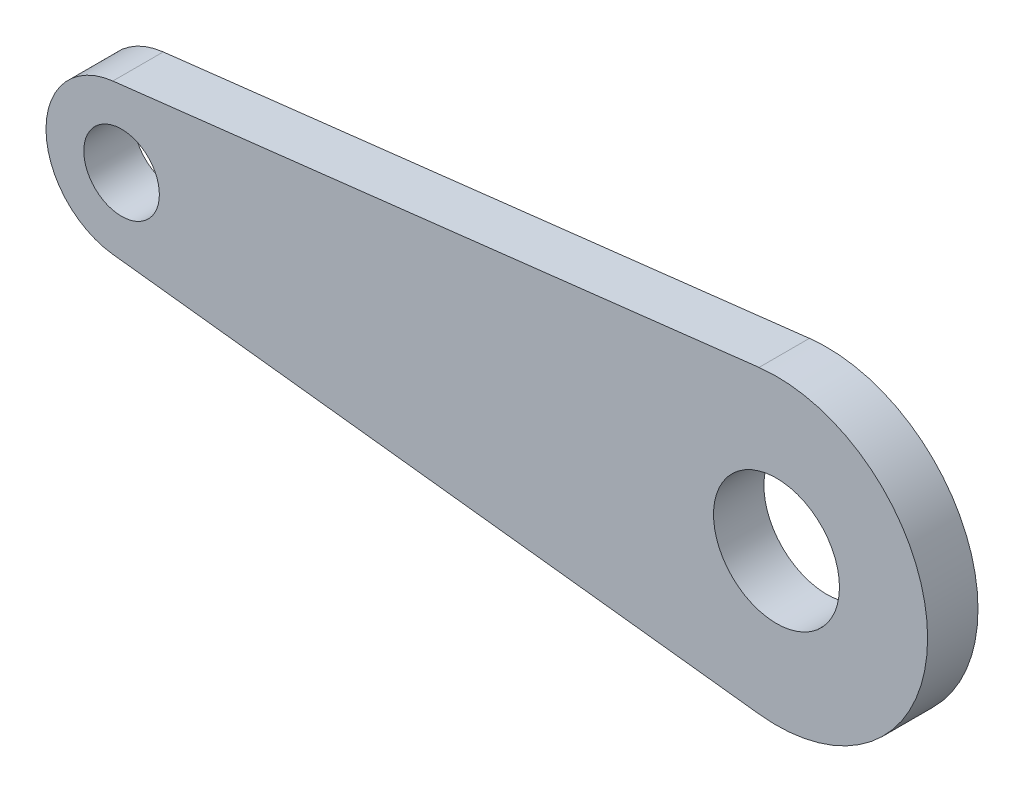
ISO-10303-21;
HEADER;
FILE_DESCRIPTION(('STEP AP214'),'2;1');
FILE_NAME('part.step','',(''),(''),'','','');
FILE_SCHEMA(('AUTOMOTIVE_DESIGN { 1 0 10303 214 1 1 1 1 }'));
ENDSEC;
DATA;
#1=APPLICATION_CONTEXT('core data for automotive mechanical design processes');
#2=APPLICATION_PROTOCOL_DEFINITION('international standard','automotive_design',2000,#1);
#3=PRODUCT_CONTEXT('',#1,'mechanical');
#4=PRODUCT('Part','Part','',(#3));
#5=PRODUCT_RELATED_PRODUCT_CATEGORY('part','',(#4));
#6=PRODUCT_DEFINITION_FORMATION('','',#4);
#7=PRODUCT_DEFINITION_CONTEXT('part definition',#1,'design');
#8=PRODUCT_DEFINITION('design','',#6,#7);
#9=PRODUCT_DEFINITION_SHAPE('','',#8);
#10=(LENGTH_UNIT() NAMED_UNIT(*) SI_UNIT(.MILLI.,.METRE.));
#11=(NAMED_UNIT(*) PLANE_ANGLE_UNIT() SI_UNIT($,.RADIAN.));
#12=(NAMED_UNIT(*) SI_UNIT($,.STERADIAN.) SOLID_ANGLE_UNIT());
#13=UNCERTAINTY_MEASURE_WITH_UNIT(LENGTH_MEASURE(1.E-05),#10,'distance_accuracy_value','');
#14=(GEOMETRIC_REPRESENTATION_CONTEXT(3) GLOBAL_UNCERTAINTY_ASSIGNED_CONTEXT((#13)) GLOBAL_UNIT_ASSIGNED_CONTEXT((#10,
#11,#12)) REPRESENTATION_CONTEXT('',''));
#15=CARTESIAN_POINT('',(0.,0.,0.));
#16=DIRECTION('',(0.,0.,1.));
#17=DIRECTION('',(1.,0.,0.));
#18=AXIS2_PLACEMENT_3D('',#15,#16,#17);
#19=CARTESIAN_POINT('',(0.,0.,10.));
#20=DIRECTION('',(0.,0.,1.));
#21=DIRECTION('',(1.,0.,0.));
#22=AXIS2_PLACEMENT_3D('',#19,#20,#21);
#23=PLANE('',#22);
#24=CARTESIAN_POINT('',(0.,0.,10.));
#25=DIRECTION('',(0.,0.,1.));
#26=DIRECTION('',(1.,0.,0.));
#27=AXIS2_PLACEMENT_3D('',#24,#25,#26);
#28=CIRCLE('',#27,7.5);
#29=CARTESIAN_POINT('',(7.5,0.,10.));
#30=VERTEX_POINT('',#29);
#31=EDGE_CURVE('E102',#30,#30,#28,.T.);
#32=ORIENTED_EDGE('',*,*,#31,.F.);
#33=EDGE_LOOP('',(#32));
#34=FACE_BOUND('',#33,.T.);
#35=CARTESIAN_POINT('',(0.,0.,10.));
#36=DIRECTION('',(0.,0.,1.));
#37=DIRECTION('',(1.,0.,0.));
#38=AXIS2_PLACEMENT_3D('',#35,#36,#37);
#39=CIRCLE('',#38,15.);
#40=CARTESIAN_POINT('',(-1.73076923076923,14.8998133501673,10.));
#41=VERTEX_POINT('',#40);
#42=CARTESIAN_POINT('',(-1.73076923076923,-14.8998133501673,10.));
#43=VERTEX_POINT('',#42);
#44=EDGE_CURVE('E87',#41,#43,#39,.T.);
#45=ORIENTED_EDGE('',*,*,#44,.T.);
#46=DIRECTION('',(0.993320890011151,-0.115384615384615,0.));
#47=VECTOR('',#46,1.);
#48=CARTESIAN_POINT('',(-1.73076923076923,-14.8998133501673,10.));
#49=LINE('',#48,#47);
#50=CARTESIAN_POINT('',(126.538461538462,-29.7996267003345,10.));
#51=VERTEX_POINT('',#50);
#52=EDGE_CURVE('E82',#43,#51,#49,.T.);
#53=ORIENTED_EDGE('',*,*,#52,.T.);
#54=CARTESIAN_POINT('',(130.,0.,10.));
#55=DIRECTION('',(0.,0.,1.));
#56=DIRECTION('',(1.,0.,0.));
#57=AXIS2_PLACEMENT_3D('',#54,#55,#56);
#58=CIRCLE('',#57,30.);
#59=CARTESIAN_POINT('',(126.538461538462,29.7996267003345,10.));
#60=VERTEX_POINT('',#59);
#61=EDGE_CURVE('E85',#51,#60,#58,.T.);
#62=ORIENTED_EDGE('',*,*,#61,.T.);
#63=DIRECTION('',(-0.993320890011151,-0.115384615384615,0.));
#64=VECTOR('',#63,1.);
#65=CARTESIAN_POINT('',(-1.73076923076923,14.8998133501673,10.));
#66=LINE('',#65,#64);
#67=EDGE_CURVE('E52',#60,#41,#66,.T.);
#68=ORIENTED_EDGE('',*,*,#67,.T.);
#69=EDGE_LOOP('',(#45,#53,#62,#68));
#70=FACE_BOUND('',#69,.T.);
#71=CARTESIAN_POINT('',(130.,0.,10.));
#72=DIRECTION('',(0.,0.,1.));
#73=DIRECTION('',(1.,0.,0.));
#74=AXIS2_PLACEMENT_3D('',#71,#72,#73);
#75=CIRCLE('',#74,12.5);
#76=CARTESIAN_POINT('',(142.5,0.,10.));
#77=VERTEX_POINT('',#76);
#78=EDGE_CURVE('E117',#77,#77,#75,.T.);
#79=ORIENTED_EDGE('',*,*,#78,.F.);
#80=EDGE_LOOP('',(#79));
#81=FACE_BOUND('',#80,.T.);
#82=ADVANCED_FACE('F35',(#34,#70,#81),#23,.T.);
#83=CARTESIAN_POINT('',(0.,0.,0.));
#84=DIRECTION('',(0.,0.,1.));
#85=DIRECTION('',(1.,0.,0.));
#86=AXIS2_PLACEMENT_3D('',#83,#84,#85);
#87=PLANE('',#86);
#88=CARTESIAN_POINT('',(0.,0.,0.));
#89=DIRECTION('',(0.,0.,1.));
#90=DIRECTION('',(1.,0.,0.));
#91=AXIS2_PLACEMENT_3D('',#88,#89,#90);
#92=CIRCLE('',#91,15.);
#93=CARTESIAN_POINT('',(-1.73076923076923,14.8998133501673,0.));
#94=VERTEX_POINT('',#93);
#95=CARTESIAN_POINT('',(-1.73076923076923,-14.8998133501673,0.));
#96=VERTEX_POINT('',#95);
#97=EDGE_CURVE('E99',#94,#96,#92,.T.);
#98=ORIENTED_EDGE('',*,*,#97,.F.);
#99=DIRECTION('',(-0.993320890011151,-0.115384615384615,0.));
#100=VECTOR('',#99,1.);
#101=CARTESIAN_POINT('',(-1.73076923076923,14.8998133501673,0.));
#102=LINE('',#101,#100);
#103=CARTESIAN_POINT('',(126.538461538462,29.7996267003345,0.));
#104=VERTEX_POINT('',#103);
#105=EDGE_CURVE('E75',#104,#94,#102,.T.);
#106=ORIENTED_EDGE('',*,*,#105,.F.);
#107=CARTESIAN_POINT('',(130.,0.,0.));
#108=DIRECTION('',(0.,0.,1.));
#109=DIRECTION('',(1.,0.,0.));
#110=AXIS2_PLACEMENT_3D('',#107,#108,#109);
#111=CIRCLE('',#110,30.);
#112=CARTESIAN_POINT('',(126.538461538462,-29.7996267003345,0.));
#113=VERTEX_POINT('',#112);
#114=EDGE_CURVE('E69',#113,#104,#111,.T.);
#115=ORIENTED_EDGE('',*,*,#114,.F.);
#116=DIRECTION('',(0.993320890011151,-0.115384615384615,0.));
#117=VECTOR('',#116,1.);
#118=CARTESIAN_POINT('',(-1.73076923076923,-14.8998133501673,0.));
#119=LINE('',#118,#117);
#120=EDGE_CURVE('E91',#96,#113,#119,.T.);
#121=ORIENTED_EDGE('',*,*,#120,.F.);
#122=EDGE_LOOP('',(#98,#106,#115,#121));
#123=FACE_BOUND('',#122,.T.);
#124=CARTESIAN_POINT('',(0.,0.,0.));
#125=DIRECTION('',(0.,0.,1.));
#126=DIRECTION('',(1.,0.,0.));
#127=AXIS2_PLACEMENT_3D('',#124,#125,#126);
#128=CIRCLE('',#127,7.5);
#129=CARTESIAN_POINT('',(7.5,0.,0.));
#130=VERTEX_POINT('',#129);
#131=EDGE_CURVE('E114',#130,#130,#128,.T.);
#132=ORIENTED_EDGE('',*,*,#131,.T.);
#133=EDGE_LOOP('',(#132));
#134=FACE_BOUND('',#133,.T.);
#135=CARTESIAN_POINT('',(130.,0.,0.));
#136=DIRECTION('',(0.,0.,1.));
#137=DIRECTION('',(1.,0.,0.));
#138=AXIS2_PLACEMENT_3D('',#135,#136,#137);
#139=CIRCLE('',#138,12.5);
#140=CARTESIAN_POINT('',(142.5,0.,0.));
#141=VERTEX_POINT('',#140);
#142=EDGE_CURVE('E120',#141,#141,#139,.T.);
#143=ORIENTED_EDGE('',*,*,#142,.T.);
#144=EDGE_LOOP('',(#143));
#145=FACE_BOUND('',#144,.T.);
#146=ADVANCED_FACE('F110',(#123,#134,#145),#87,.F.);
#147=CARTESIAN_POINT('',(0.,0.,10.));
#148=DIRECTION('',(0.,0.,-1.));
#149=DIRECTION('',(-1.,0.,0.));
#150=AXIS2_PLACEMENT_3D('',#147,#148,#149);
#151=CYLINDRICAL_SURFACE('',#150,15.);
#152=ORIENTED_EDGE('',*,*,#97,.T.);
#153=DIRECTION('',(0.,0.,-1.));
#154=VECTOR('',#153,1.);
#155=CARTESIAN_POINT('',(-1.73076923076923,-14.8998133501673,10.));
#156=LINE('',#155,#154);
#157=EDGE_CURVE('E11',#43,#96,#156,.T.);
#158=ORIENTED_EDGE('',*,*,#157,.F.);
#159=ORIENTED_EDGE('',*,*,#44,.F.);
#160=DIRECTION('',(0.,0.,-1.));
#161=VECTOR('',#160,1.);
#162=CARTESIAN_POINT('',(-1.73076923076923,14.8998133501673,10.));
#163=LINE('',#162,#161);
#164=EDGE_CURVE('E95',#41,#94,#163,.T.);
#165=ORIENTED_EDGE('',*,*,#164,.T.);
#166=EDGE_LOOP('',(#152,#158,#159,#165));
#167=FACE_BOUND('',#166,.T.);
#168=ADVANCED_FACE('F37',(#167),#151,.T.);
#169=CARTESIAN_POINT('',(-1.73076923076923,-14.8998133501673,10.));
#170=DIRECTION('',(0.115384615384615,0.993320890011151,0.));
#171=DIRECTION('',(-0.993320890011151,0.115384615384615,0.));
#172=AXIS2_PLACEMENT_3D('',#169,#170,#171);
#173=PLANE('',#172);
#174=ORIENTED_EDGE('',*,*,#120,.T.);
#175=DIRECTION('',(0.,0.,-1.));
#176=VECTOR('',#175,1.);
#177=CARTESIAN_POINT('',(126.538461538462,-29.7996267003345,10.));
#178=LINE('',#177,#176);
#179=EDGE_CURVE('E44',#51,#113,#178,.T.);
#180=ORIENTED_EDGE('',*,*,#179,.F.);
#181=ORIENTED_EDGE('',*,*,#52,.F.);
#182=ORIENTED_EDGE('',*,*,#157,.T.);
#183=EDGE_LOOP('',(#174,#180,#181,#182));
#184=FACE_BOUND('',#183,.T.);
#185=ADVANCED_FACE('F90',(#184),#173,.F.);
#186=CARTESIAN_POINT('',(130.,0.,10.));
#187=DIRECTION('',(0.,0.,-1.));
#188=DIRECTION('',(-1.,0.,0.));
#189=AXIS2_PLACEMENT_3D('',#186,#187,#188);
#190=CYLINDRICAL_SURFACE('',#189,30.);
#191=ORIENTED_EDGE('',*,*,#114,.T.);
#192=DIRECTION('',(0.,0.,-1.));
#193=VECTOR('',#192,1.);
#194=CARTESIAN_POINT('',(126.538461538462,29.7996267003345,10.));
#195=LINE('',#194,#193);
#196=EDGE_CURVE('E92',#60,#104,#195,.T.);
#197=ORIENTED_EDGE('',*,*,#196,.F.);
#198=ORIENTED_EDGE('',*,*,#61,.F.);
#199=ORIENTED_EDGE('',*,*,#179,.T.);
#200=EDGE_LOOP('',(#191,#197,#198,#199));
#201=FACE_BOUND('',#200,.T.);
#202=ADVANCED_FACE('F93',(#201),#190,.T.);
#203=CARTESIAN_POINT('',(-1.73076923076923,14.8998133501673,10.));
#204=DIRECTION('',(0.115384615384615,-0.993320890011151,0.));
#205=DIRECTION('',(0.993320890011151,0.115384615384615,0.));
#206=AXIS2_PLACEMENT_3D('',#203,#204,#205);
#207=PLANE('',#206);
#208=ORIENTED_EDGE('',*,*,#105,.T.);
#209=ORIENTED_EDGE('',*,*,#164,.F.);
#210=ORIENTED_EDGE('',*,*,#67,.F.);
#211=ORIENTED_EDGE('',*,*,#196,.T.);
#212=EDGE_LOOP('',(#208,#209,#210,#211));
#213=FACE_BOUND('',#212,.T.);
#214=ADVANCED_FACE('F107',(#213),#207,.F.);
#215=CARTESIAN_POINT('',(0.,0.,10.));
#216=DIRECTION('',(0.,0.,-1.));
#217=DIRECTION('',(-1.,0.,0.));
#218=AXIS2_PLACEMENT_3D('',#215,#216,#217);
#219=CYLINDRICAL_SURFACE('',#218,7.5);
#220=ORIENTED_EDGE('',*,*,#31,.T.);
#221=EDGE_LOOP('',(#220));
#222=FACE_BOUND('',#221,.T.);
#223=ORIENTED_EDGE('',*,*,#131,.F.);
#224=EDGE_LOOP('',(#223));
#225=FACE_BOUND('',#224,.T.);
#226=ADVANCED_FACE('F137',(#222,#225),#219,.F.);
#227=CARTESIAN_POINT('',(130.,0.,10.));
#228=DIRECTION('',(0.,0.,-1.));
#229=DIRECTION('',(-1.,0.,0.));
#230=AXIS2_PLACEMENT_3D('',#227,#228,#229);
#231=CYLINDRICAL_SURFACE('',#230,12.5);
#232=ORIENTED_EDGE('',*,*,#78,.T.);
#233=EDGE_LOOP('',(#232));
#234=FACE_BOUND('',#233,.T.);
#235=ORIENTED_EDGE('',*,*,#142,.F.);
#236=EDGE_LOOP('',(#235));
#237=FACE_BOUND('',#236,.T.);
#238=ADVANCED_FACE('F126',(#234,#237),#231,.F.);
#239=CLOSED_SHELL('',(#82,#146,#168,#185,#202,#214,#226,#238));
#240=MANIFOLD_SOLID_BREP('B2',#239);
#241=ADVANCED_BREP_SHAPE_REPRESENTATION('',(#18,#240),#14);
#242=SHAPE_DEFINITION_REPRESENTATION(#9,#241);
ENDSEC;
END-ISO-10303-21;
